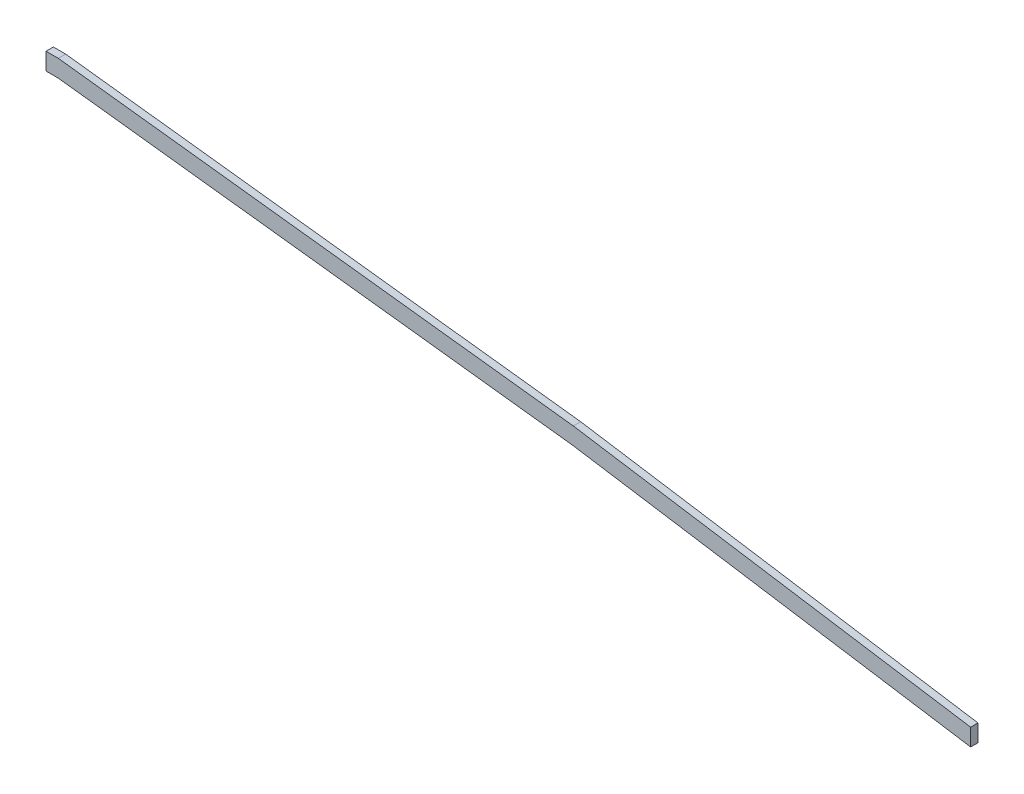
ISO-10303-21;
HEADER;
FILE_DESCRIPTION(('STEP AP214'),'2;1');
FILE_NAME('part.step','',(''),(''),'','','');
FILE_SCHEMA(('AUTOMOTIVE_DESIGN { 1 0 10303 214 1 1 1 1 }'));
ENDSEC;
DATA;
#1=APPLICATION_CONTEXT('core data for automotive mechanical design processes');
#2=APPLICATION_PROTOCOL_DEFINITION('international standard','automotive_design',2000,#1);
#3=PRODUCT_CONTEXT('',#1,'mechanical');
#4=PRODUCT('Part','Part','',(#3));
#5=PRODUCT_RELATED_PRODUCT_CATEGORY('part','',(#4));
#6=PRODUCT_DEFINITION_FORMATION('','',#4);
#7=PRODUCT_DEFINITION_CONTEXT('part definition',#1,'design');
#8=PRODUCT_DEFINITION('design','',#6,#7);
#9=PRODUCT_DEFINITION_SHAPE('','',#8);
#10=(LENGTH_UNIT() NAMED_UNIT(*) SI_UNIT(.MILLI.,.METRE.));
#11=(NAMED_UNIT(*) PLANE_ANGLE_UNIT() SI_UNIT($,.RADIAN.));
#12=(NAMED_UNIT(*) SI_UNIT($,.STERADIAN.) SOLID_ANGLE_UNIT());
#13=UNCERTAINTY_MEASURE_WITH_UNIT(LENGTH_MEASURE(1.E-05),#10,'distance_accuracy_value','');
#14=(GEOMETRIC_REPRESENTATION_CONTEXT(3) GLOBAL_UNCERTAINTY_ASSIGNED_CONTEXT((#13)) GLOBAL_UNIT_ASSIGNED_CONTEXT((#10,
#11,#12)) REPRESENTATION_CONTEXT('',''));
#15=CARTESIAN_POINT('',(0.,0.,0.));
#16=DIRECTION('',(0.,0.,1.));
#17=DIRECTION('',(1.,0.,0.));
#18=AXIS2_PLACEMENT_3D('',#15,#16,#17);
#19=CARTESIAN_POINT('',(0.,0.,3.));
#20=DIRECTION('',(0.,-1.,0.));
#21=DIRECTION('',(1.,0.,0.));
#22=AXIS2_PLACEMENT_3D('',#19,#20,#21);
#23=PLANE('',#22);
#24=DIRECTION('',(-1.,0.,0.));
#25=VECTOR('',#24,1.);
#26=CARTESIAN_POINT('',(0.,0.,0.));
#27=LINE('',#26,#25);
#28=CARTESIAN_POINT('',(0.,0.,0.));
#29=VERTEX_POINT('',#28);
#30=CARTESIAN_POINT('',(-5.,0.,0.));
#31=VERTEX_POINT('',#30);
#32=EDGE_CURVE('E133',#29,#31,#27,.T.);
#33=ORIENTED_EDGE('',*,*,#32,.T.);
#34=DIRECTION('',(0.,0.,-1.));
#35=VECTOR('',#34,1.);
#36=CARTESIAN_POINT('',(-5.,0.,3.));
#37=LINE('',#36,#35);
#38=CARTESIAN_POINT('',(-5.,0.,3.));
#39=VERTEX_POINT('',#38);
#40=EDGE_CURVE('E11',#39,#31,#37,.T.);
#41=ORIENTED_EDGE('',*,*,#40,.F.);
#42=DIRECTION('',(-1.,0.,0.));
#43=VECTOR('',#42,1.);
#44=CARTESIAN_POINT('',(0.,0.,3.));
#45=LINE('',#44,#43);
#46=CARTESIAN_POINT('',(0.,0.,3.));
#47=VERTEX_POINT('',#46);
#48=EDGE_CURVE('E147',#47,#39,#45,.T.);
#49=ORIENTED_EDGE('',*,*,#48,.F.);
#50=DIRECTION('',(0.,0.,-1.));
#51=VECTOR('',#50,1.);
#52=CARTESIAN_POINT('',(0.,0.,3.));
#53=LINE('',#52,#51);
#54=EDGE_CURVE('E129',#47,#29,#53,.T.);
#55=ORIENTED_EDGE('',*,*,#54,.T.);
#56=EDGE_LOOP('',(#33,#41,#49,#55));
#57=FACE_BOUND('',#56,.T.);
#58=ADVANCED_FACE('F37',(#57),#23,.F.);
#59=CARTESIAN_POINT('',(-5.,0.,3.));
#60=DIRECTION('',(1.,0.,0.));
#61=DIRECTION('',(0.,0.,-1.));
#62=AXIS2_PLACEMENT_3D('',#59,#60,#61);
#63=PLANE('',#62);
#64=DIRECTION('',(0.,-1.,0.));
#65=VECTOR('',#64,1.);
#66=CARTESIAN_POINT('',(-5.,0.,0.));
#67=LINE('',#66,#65);
#68=CARTESIAN_POINT('',(-5.,-7.,0.));
#69=VERTEX_POINT('',#68);
#70=EDGE_CURVE('E136',#31,#69,#67,.T.);
#71=ORIENTED_EDGE('',*,*,#70,.T.);
#72=DIRECTION('',(0.,0.,-1.));
#73=VECTOR('',#72,1.);
#74=CARTESIAN_POINT('',(-5.,-7.,3.));
#75=LINE('',#74,#73);
#76=CARTESIAN_POINT('',(-5.,-7.,3.));
#77=VERTEX_POINT('',#76);
#78=EDGE_CURVE('E45',#77,#69,#75,.T.);
#79=ORIENTED_EDGE('',*,*,#78,.F.);
#80=DIRECTION('',(0.,-1.,0.));
#81=VECTOR('',#80,1.);
#82=CARTESIAN_POINT('',(-5.,0.,3.));
#83=LINE('',#82,#81);
#84=EDGE_CURVE('E96',#39,#77,#83,.T.);
#85=ORIENTED_EDGE('',*,*,#84,.F.);
#86=ORIENTED_EDGE('',*,*,#40,.T.);
#87=EDGE_LOOP('',(#71,#79,#85,#86));
#88=FACE_BOUND('',#87,.T.);
#89=ADVANCED_FACE('F182',(#88),#63,.F.);
#90=CARTESIAN_POINT('',(0.,-7.,3.));
#91=DIRECTION('',(0.,1.,0.));
#92=DIRECTION('',(-1.,0.,0.));
#93=AXIS2_PLACEMENT_3D('',#90,#91,#92);
#94=PLANE('',#93);
#95=DIRECTION('',(1.,0.,0.));
#96=VECTOR('',#95,1.);
#97=CARTESIAN_POINT('',(0.,-7.,0.));
#98=LINE('',#97,#96);
#99=CARTESIAN_POINT('',(0.,-7.,0.));
#100=VERTEX_POINT('',#99);
#101=EDGE_CURVE('E138',#69,#100,#98,.T.);
#102=ORIENTED_EDGE('',*,*,#101,.T.);
#103=DIRECTION('',(0.,0.,-1.));
#104=VECTOR('',#103,1.);
#105=CARTESIAN_POINT('',(0.,-7.,3.));
#106=LINE('',#105,#104);
#107=CARTESIAN_POINT('',(0.,-7.,3.));
#108=VERTEX_POINT('',#107);
#109=EDGE_CURVE('E154',#108,#100,#106,.T.);
#110=ORIENTED_EDGE('',*,*,#109,.F.);
#111=DIRECTION('',(1.,0.,0.));
#112=VECTOR('',#111,1.);
#113=CARTESIAN_POINT('',(0.,-7.,3.));
#114=LINE('',#113,#112);
#115=EDGE_CURVE('E162',#77,#108,#114,.T.);
#116=ORIENTED_EDGE('',*,*,#115,.F.);
#117=ORIENTED_EDGE('',*,*,#78,.T.);
#118=EDGE_LOOP('',(#102,#110,#116,#117));
#119=FACE_BOUND('',#118,.T.);
#120=ADVANCED_FACE('F160',(#119),#94,.F.);
#121=CARTESIAN_POINT('',(0.,-7.,3.));
#122=DIRECTION('',(0.117364072525809,0.993088955975323,0.));
#123=DIRECTION('',(-0.993088955975323,0.117364072525809,0.));
#124=AXIS2_PLACEMENT_3D('',#121,#122,#123);
#125=PLANE('',#124);
#126=DIRECTION('',(0.993088955975323,-0.117364072525809,0.));
#127=VECTOR('',#126,1.);
#128=CARTESIAN_POINT('',(0.,-7.,0.));
#129=LINE('',#128,#127);
#130=CARTESIAN_POINT('',(210.,-31.8179733367534,0.));
#131=VERTEX_POINT('',#130);
#132=EDGE_CURVE('E140',#100,#131,#129,.T.);
#133=ORIENTED_EDGE('',*,*,#132,.T.);
#134=DIRECTION('',(0.,0.,-1.));
#135=VECTOR('',#134,1.);
#136=CARTESIAN_POINT('',(210.,-31.8179733367534,3.));
#137=LINE('',#136,#135);
#138=CARTESIAN_POINT('',(210.,-31.8179733367534,3.));
#139=VERTEX_POINT('',#138);
#140=EDGE_CURVE('E151',#139,#131,#137,.T.);
#141=ORIENTED_EDGE('',*,*,#140,.F.);
#142=DIRECTION('',(0.993088955975323,-0.117364072525809,0.));
#143=VECTOR('',#142,1.);
#144=CARTESIAN_POINT('',(0.,-7.,3.));
#145=LINE('',#144,#143);
#146=EDGE_CURVE('E174',#108,#139,#145,.T.);
#147=ORIENTED_EDGE('',*,*,#146,.F.);
#148=ORIENTED_EDGE('',*,*,#109,.T.);
#149=EDGE_LOOP('',(#133,#141,#147,#148));
#150=FACE_BOUND('',#149,.T.);
#151=ADVANCED_FACE('F170',(#150),#125,.F.);
#152=CARTESIAN_POINT('',(210.,-31.8179733367534,3.));
#153=DIRECTION('',(0.154710386299472,0.987959865769389,0.));
#154=DIRECTION('',(-0.987959865769389,0.154710386299472,0.));
#155=AXIS2_PLACEMENT_3D('',#152,#153,#154);
#156=PLANE('',#155);
#157=DIRECTION('',(0.987959865769388,-0.154710386299472,0.));
#158=VECTOR('',#157,1.);
#159=CARTESIAN_POINT('',(210.,-31.8179733367534,0.));
#160=LINE('',#159,#158);
#161=CARTESIAN_POINT('',(372.,-57.1864963394527,0.));
#162=VERTEX_POINT('',#161);
#163=EDGE_CURVE('E142',#131,#162,#160,.T.);
#164=ORIENTED_EDGE('',*,*,#163,.T.);
#165=DIRECTION('',(0.,0.,-1.));
#166=VECTOR('',#165,1.);
#167=CARTESIAN_POINT('',(372.,-57.1864963394527,3.));
#168=LINE('',#167,#166);
#169=CARTESIAN_POINT('',(372.,-57.1864963394527,3.));
#170=VERTEX_POINT('',#169);
#171=EDGE_CURVE('E124',#170,#162,#168,.T.);
#172=ORIENTED_EDGE('',*,*,#171,.F.);
#173=DIRECTION('',(0.987959865769388,-0.154710386299472,0.));
#174=VECTOR('',#173,1.);
#175=CARTESIAN_POINT('',(210.,-31.8179733367534,3.));
#176=LINE('',#175,#174);
#177=EDGE_CURVE('E115',#139,#170,#176,.T.);
#178=ORIENTED_EDGE('',*,*,#177,.F.);
#179=ORIENTED_EDGE('',*,*,#140,.T.);
#180=EDGE_LOOP('',(#164,#172,#178,#179));
#181=FACE_BOUND('',#180,.T.);
#182=ADVANCED_FACE('F173',(#181),#156,.F.);
#183=CARTESIAN_POINT('',(372.,-57.1864963394527,3.));
#184=DIRECTION('',(-1.,0.,0.));
#185=DIRECTION('',(0.,0.,1.));
#186=AXIS2_PLACEMENT_3D('',#183,#184,#185);
#187=PLANE('',#186);
#188=DIRECTION('',(0.,1.,0.));
#189=VECTOR('',#188,1.);
#190=CARTESIAN_POINT('',(372.,-57.1864963394527,0.));
#191=LINE('',#190,#189);
#192=CARTESIAN_POINT('',(372.,-50.1864963394527,0.));
#193=VERTEX_POINT('',#192);
#194=EDGE_CURVE('E123',#162,#193,#191,.T.);
#195=ORIENTED_EDGE('',*,*,#194,.T.);
#196=DIRECTION('',(0.,0.,-1.));
#197=VECTOR('',#196,1.);
#198=CARTESIAN_POINT('',(372.,-50.1864963394527,3.));
#199=LINE('',#198,#197);
#200=CARTESIAN_POINT('',(372.,-50.1864963394527,3.));
#201=VERTEX_POINT('',#200);
#202=EDGE_CURVE('E120',#201,#193,#199,.T.);
#203=ORIENTED_EDGE('',*,*,#202,.F.);
#204=DIRECTION('',(0.,1.,0.));
#205=VECTOR('',#204,1.);
#206=CARTESIAN_POINT('',(372.,-57.1864963394527,3.));
#207=LINE('',#206,#205);
#208=EDGE_CURVE('E109',#170,#201,#207,.T.);
#209=ORIENTED_EDGE('',*,*,#208,.F.);
#210=ORIENTED_EDGE('',*,*,#171,.T.);
#211=EDGE_LOOP('',(#195,#203,#209,#210));
#212=FACE_BOUND('',#211,.T.);
#213=ADVANCED_FACE('F121',(#212),#187,.F.);
#214=CARTESIAN_POINT('',(372.,-50.1864963394527,3.));
#215=DIRECTION('',(-0.154710386299472,-0.987959865769389,0.));
#216=DIRECTION('',(0.987959865769389,-0.154710386299472,0.));
#217=AXIS2_PLACEMENT_3D('',#214,#215,#216);
#218=PLANE('',#217);
#219=DIRECTION('',(-0.987959865769388,0.154710386299472,0.));
#220=VECTOR('',#219,1.);
#221=CARTESIAN_POINT('',(372.,-50.1864963394527,0.));
#222=LINE('',#221,#220);
#223=CARTESIAN_POINT('',(210.,-24.8179733367534,0.));
#224=VERTEX_POINT('',#223);
#225=EDGE_CURVE('E82',#193,#224,#222,.T.);
#226=ORIENTED_EDGE('',*,*,#225,.T.);
#227=DIRECTION('',(0.,0.,-1.));
#228=VECTOR('',#227,1.);
#229=CARTESIAN_POINT('',(210.,-24.8179733367534,3.));
#230=LINE('',#229,#228);
#231=CARTESIAN_POINT('',(210.,-24.8179733367534,3.));
#232=VERTEX_POINT('',#231);
#233=EDGE_CURVE('E125',#232,#224,#230,.T.);
#234=ORIENTED_EDGE('',*,*,#233,.F.);
#235=DIRECTION('',(-0.987959865769388,0.154710386299472,0.));
#236=VECTOR('',#235,1.);
#237=CARTESIAN_POINT('',(372.,-50.1864963394527,3.));
#238=LINE('',#237,#236);
#239=EDGE_CURVE('E113',#201,#232,#238,.T.);
#240=ORIENTED_EDGE('',*,*,#239,.F.);
#241=ORIENTED_EDGE('',*,*,#202,.T.);
#242=EDGE_LOOP('',(#226,#234,#240,#241));
#243=FACE_BOUND('',#242,.T.);
#244=ADVANCED_FACE('F127',(#243),#218,.F.);
#245=CARTESIAN_POINT('',(210.,-24.8179733367534,3.));
#246=DIRECTION('',(-0.117364072525809,-0.993088955975323,0.));
#247=DIRECTION('',(0.993088955975323,-0.117364072525809,0.));
#248=AXIS2_PLACEMENT_3D('',#245,#246,#247);
#249=PLANE('',#248);
#250=DIRECTION('',(-0.993088955975323,0.117364072525809,0.));
#251=VECTOR('',#250,1.);
#252=CARTESIAN_POINT('',(210.,-24.8179733367534,0.));
#253=LINE('',#252,#251);
#254=EDGE_CURVE('E88',#224,#29,#253,.T.);
#255=ORIENTED_EDGE('',*,*,#254,.T.);
#256=ORIENTED_EDGE('',*,*,#54,.F.);
#257=DIRECTION('',(-0.993088955975323,0.117364072525809,0.));
#258=VECTOR('',#257,1.);
#259=CARTESIAN_POINT('',(210.,-24.8179733367534,3.));
#260=LINE('',#259,#258);
#261=EDGE_CURVE('E53',#232,#47,#260,.T.);
#262=ORIENTED_EDGE('',*,*,#261,.F.);
#263=ORIENTED_EDGE('',*,*,#233,.T.);
#264=EDGE_LOOP('',(#255,#256,#262,#263));
#265=FACE_BOUND('',#264,.T.);
#266=ADVANCED_FACE('F198',(#265),#249,.F.);
#267=CARTESIAN_POINT('',(0.,0.,3.));
#268=DIRECTION('',(0.,0.,1.));
#269=DIRECTION('',(1.,0.,0.));
#270=AXIS2_PLACEMENT_3D('',#267,#268,#269);
#271=PLANE('',#270);
#272=ORIENTED_EDGE('',*,*,#48,.T.);
#273=ORIENTED_EDGE('',*,*,#84,.T.);
#274=ORIENTED_EDGE('',*,*,#115,.T.);
#275=ORIENTED_EDGE('',*,*,#146,.T.);
#276=ORIENTED_EDGE('',*,*,#177,.T.);
#277=ORIENTED_EDGE('',*,*,#208,.T.);
#278=ORIENTED_EDGE('',*,*,#239,.T.);
#279=ORIENTED_EDGE('',*,*,#261,.T.);
#280=EDGE_LOOP('',(#272,#273,#274,#275,#276,#277,#278,#279));
#281=FACE_BOUND('',#280,.T.);
#282=ADVANCED_FACE('F111',(#281),#271,.T.);
#283=CARTESIAN_POINT('',(0.,0.,0.));
#284=DIRECTION('',(0.,0.,1.));
#285=DIRECTION('',(1.,0.,0.));
#286=AXIS2_PLACEMENT_3D('',#283,#284,#285);
#287=PLANE('',#286);
#288=ORIENTED_EDGE('',*,*,#32,.F.);
#289=ORIENTED_EDGE('',*,*,#254,.F.);
#290=ORIENTED_EDGE('',*,*,#225,.F.);
#291=ORIENTED_EDGE('',*,*,#194,.F.);
#292=ORIENTED_EDGE('',*,*,#163,.F.);
#293=ORIENTED_EDGE('',*,*,#132,.F.);
#294=ORIENTED_EDGE('',*,*,#101,.F.);
#295=ORIENTED_EDGE('',*,*,#70,.F.);
#296=EDGE_LOOP('',(#288,#289,#290,#291,#292,#293,#294,#295));
#297=FACE_BOUND('',#296,.T.);
#298=ADVANCED_FACE('F166',(#297),#287,.F.);
#299=CLOSED_SHELL('',(#58,#89,#120,#151,#182,#213,#244,#266,#282,#298));
#300=MANIFOLD_SOLID_BREP('B2',#299);
#301=ADVANCED_BREP_SHAPE_REPRESENTATION('',(#18,#300),#14);
#302=SHAPE_DEFINITION_REPRESENTATION(#9,#301);
ENDSEC;
END-ISO-10303-21;
